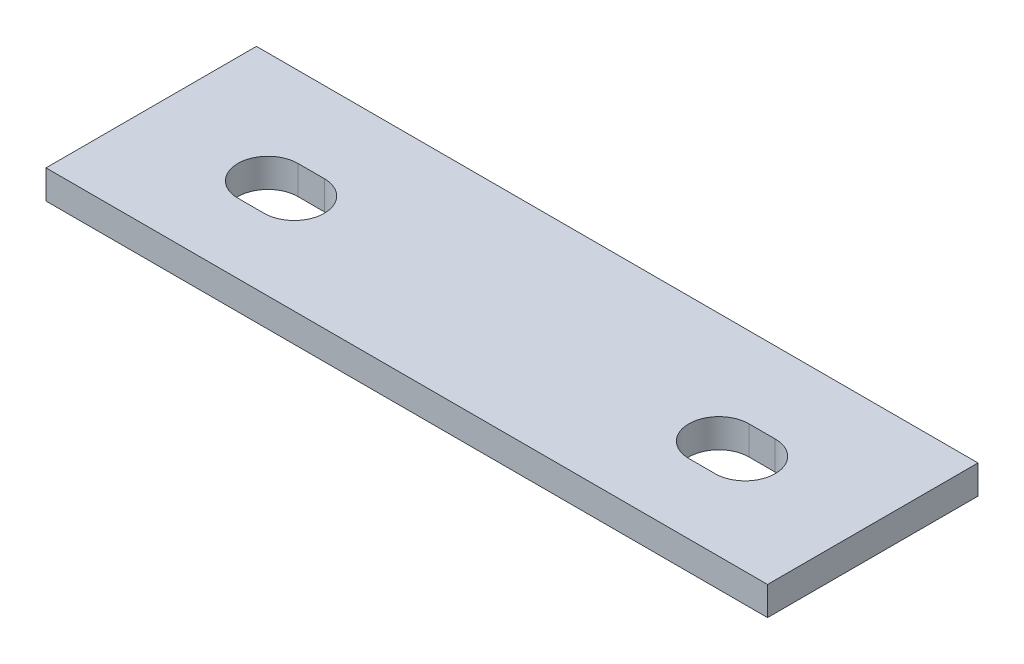
ISO-10303-21;
HEADER;
FILE_DESCRIPTION(('STEP AP214'),'2;1');
FILE_NAME('part.step','',(''),(''),'','','');
FILE_SCHEMA(('AUTOMOTIVE_DESIGN { 1 0 10303 214 1 1 1 1 }'));
ENDSEC;
DATA;
#1=APPLICATION_CONTEXT('core data for automotive mechanical design processes');
#2=APPLICATION_PROTOCOL_DEFINITION('international standard','automotive_design',2000,#1);
#3=PRODUCT_CONTEXT('',#1,'mechanical');
#4=PRODUCT('Part','Part','',(#3));
#5=PRODUCT_RELATED_PRODUCT_CATEGORY('part','',(#4));
#6=PRODUCT_DEFINITION_FORMATION('','',#4);
#7=PRODUCT_DEFINITION_CONTEXT('part definition',#1,'design');
#8=PRODUCT_DEFINITION('design','',#6,#7);
#9=PRODUCT_DEFINITION_SHAPE('','',#8);
#10=(LENGTH_UNIT() NAMED_UNIT(*) SI_UNIT(.MILLI.,.METRE.));
#11=(NAMED_UNIT(*) PLANE_ANGLE_UNIT() SI_UNIT($,.RADIAN.));
#12=(NAMED_UNIT(*) SI_UNIT($,.STERADIAN.) SOLID_ANGLE_UNIT());
#13=UNCERTAINTY_MEASURE_WITH_UNIT(LENGTH_MEASURE(1.E-05),#10,'distance_accuracy_value','');
#14=(GEOMETRIC_REPRESENTATION_CONTEXT(3) GLOBAL_UNCERTAINTY_ASSIGNED_CONTEXT((#13)) GLOBAL_UNIT_ASSIGNED_CONTEXT((#10,
#11,#12)) REPRESENTATION_CONTEXT('',''));
#15=CARTESIAN_POINT('',(0.,0.,0.));
#16=DIRECTION('',(0.,0.,1.));
#17=DIRECTION('',(1.,0.,0.));
#18=AXIS2_PLACEMENT_3D('',#15,#16,#17);
#19=CARTESIAN_POINT('',(0.,-6.07314,0.));
#20=DIRECTION('',(-1.,0.,0.));
#21=DIRECTION('',(0.,0.,1.));
#22=AXIS2_PLACEMENT_3D('',#19,#20,#21);
#23=PLANE('',#22);
#24=DIRECTION('',(0.,0.,1.));
#25=VECTOR('',#24,1.);
#26=CARTESIAN_POINT('',(0.,0.,0.));
#27=LINE('',#26,#25);
#28=CARTESIAN_POINT('',(0.,0.,-44.45));
#29=VERTEX_POINT('',#28);
#30=CARTESIAN_POINT('',(0.,0.,0.));
#31=VERTEX_POINT('',#30);
#32=EDGE_CURVE('E151',#29,#31,#27,.T.);
#33=ORIENTED_EDGE('',*,*,#32,.F.);
#34=DIRECTION('',(0.,1.,0.));
#35=VECTOR('',#34,1.);
#36=CARTESIAN_POINT('',(0.,-6.07314,-44.45));
#37=LINE('',#36,#35);
#38=CARTESIAN_POINT('',(0.,-6.07314,-44.45));
#39=VERTEX_POINT('',#38);
#40=EDGE_CURVE('E11',#39,#29,#37,.T.);
#41=ORIENTED_EDGE('',*,*,#40,.F.);
#42=DIRECTION('',(0.,0.,1.));
#43=VECTOR('',#42,1.);
#44=CARTESIAN_POINT('',(0.,-6.07314,0.));
#45=LINE('',#44,#43);
#46=CARTESIAN_POINT('',(0.,-6.07314,0.));
#47=VERTEX_POINT('',#46);
#48=EDGE_CURVE('E170',#39,#47,#45,.T.);
#49=ORIENTED_EDGE('',*,*,#48,.T.);
#50=DIRECTION('',(0.,1.,0.));
#51=VECTOR('',#50,1.);
#52=CARTESIAN_POINT('',(0.,-6.07314,0.));
#53=LINE('',#52,#51);
#54=EDGE_CURVE('E92',#47,#31,#53,.T.);
#55=ORIENTED_EDGE('',*,*,#54,.T.);
#56=EDGE_LOOP('',(#33,#41,#49,#55));
#57=FACE_BOUND('',#56,.T.);
#58=ADVANCED_FACE('F38',(#57),#23,.T.);
#59=CARTESIAN_POINT('',(0.,-6.07314,-44.45));
#60=DIRECTION('',(0.,0.,-1.));
#61=DIRECTION('',(-1.,0.,0.));
#62=AXIS2_PLACEMENT_3D('',#59,#60,#61);
#63=PLANE('',#62);
#64=DIRECTION('',(-1.,0.,0.));
#65=VECTOR('',#64,1.);
#66=CARTESIAN_POINT('',(0.,0.,-44.45));
#67=LINE('',#66,#65);
#68=CARTESIAN_POINT('',(152.4,0.,-44.45));
#69=VERTEX_POINT('',#68);
#70=EDGE_CURVE('E169',#69,#29,#67,.T.);
#71=ORIENTED_EDGE('',*,*,#70,.F.);
#72=DIRECTION('',(0.,1.,0.));
#73=VECTOR('',#72,1.);
#74=CARTESIAN_POINT('',(152.4,-6.07314,-44.45));
#75=LINE('',#74,#73);
#76=CARTESIAN_POINT('',(152.4,-6.07314,-44.45));
#77=VERTEX_POINT('',#76);
#78=EDGE_CURVE('E46',#77,#69,#75,.T.);
#79=ORIENTED_EDGE('',*,*,#78,.F.);
#80=DIRECTION('',(-1.,0.,0.));
#81=VECTOR('',#80,1.);
#82=CARTESIAN_POINT('',(0.,-6.07314,-44.45));
#83=LINE('',#82,#81);
#84=EDGE_CURVE('E164',#77,#39,#83,.T.);
#85=ORIENTED_EDGE('',*,*,#84,.T.);
#86=ORIENTED_EDGE('',*,*,#40,.T.);
#87=EDGE_LOOP('',(#71,#79,#85,#86));
#88=FACE_BOUND('',#87,.T.);
#89=ADVANCED_FACE('F216',(#88),#63,.T.);
#90=CARTESIAN_POINT('',(152.4,-6.07314,0.));
#91=DIRECTION('',(1.,0.,0.));
#92=DIRECTION('',(0.,0.,-1.));
#93=AXIS2_PLACEMENT_3D('',#90,#91,#92);
#94=PLANE('',#93);
#95=DIRECTION('',(0.,0.,-1.));
#96=VECTOR('',#95,1.);
#97=CARTESIAN_POINT('',(152.4,0.,0.));
#98=LINE('',#97,#96);
#99=CARTESIAN_POINT('',(152.4,0.,0.));
#100=VERTEX_POINT('',#99);
#101=EDGE_CURVE('E161',#100,#69,#98,.T.);
#102=ORIENTED_EDGE('',*,*,#101,.F.);
#103=DIRECTION('',(0.,1.,0.));
#104=VECTOR('',#103,1.);
#105=CARTESIAN_POINT('',(152.4,-6.07314,0.));
#106=LINE('',#105,#104);
#107=CARTESIAN_POINT('',(152.4,-6.07314,0.));
#108=VERTEX_POINT('',#107);
#109=EDGE_CURVE('E173',#108,#100,#106,.T.);
#110=ORIENTED_EDGE('',*,*,#109,.F.);
#111=DIRECTION('',(0.,0.,-1.));
#112=VECTOR('',#111,1.);
#113=CARTESIAN_POINT('',(152.4,-6.07314,0.));
#114=LINE('',#113,#112);
#115=EDGE_CURVE('E205',#108,#77,#114,.T.);
#116=ORIENTED_EDGE('',*,*,#115,.T.);
#117=ORIENTED_EDGE('',*,*,#78,.T.);
#118=EDGE_LOOP('',(#102,#110,#116,#117));
#119=FACE_BOUND('',#118,.T.);
#120=ADVANCED_FACE('F267',(#119),#94,.T.);
#121=CARTESIAN_POINT('',(0.,-6.07314,0.));
#122=DIRECTION('',(0.,0.,1.));
#123=DIRECTION('',(1.,0.,0.));
#124=AXIS2_PLACEMENT_3D('',#121,#122,#123);
#125=PLANE('',#124);
#126=DIRECTION('',(1.,0.,0.));
#127=VECTOR('',#126,1.);
#128=CARTESIAN_POINT('',(0.,0.,0.));
#129=LINE('',#128,#127);
#130=EDGE_CURVE('E156',#31,#100,#129,.T.);
#131=ORIENTED_EDGE('',*,*,#130,.F.);
#132=ORIENTED_EDGE('',*,*,#54,.F.);
#133=DIRECTION('',(1.,0.,0.));
#134=VECTOR('',#133,1.);
#135=CARTESIAN_POINT('',(0.,-6.07314,0.));
#136=LINE('',#135,#134);
#137=EDGE_CURVE('E203',#47,#108,#136,.T.);
#138=ORIENTED_EDGE('',*,*,#137,.T.);
#139=ORIENTED_EDGE('',*,*,#109,.T.);
#140=EDGE_LOOP('',(#131,#132,#138,#139));
#141=FACE_BOUND('',#140,.T.);
#142=ADVANCED_FACE('F271',(#141),#125,.T.);
#143=CARTESIAN_POINT('',(0.,-6.07314,0.));
#144=DIRECTION('',(0.,-1.,0.));
#145=DIRECTION('',(0.,0.,-1.));
#146=AXIS2_PLACEMENT_3D('',#143,#144,#145);
#147=PLANE('',#146);
#148=DIRECTION('',(-1.,0.,0.));
#149=VECTOR('',#148,1.);
#150=CARTESIAN_POINT('',(2.22044604925031E-13,-6.07314,-27.4218400000007));
#151=LINE('',#150,#149);
#152=CARTESIAN_POINT('',(121.046875,-6.07314,-27.4218399999996));
#153=VERTEX_POINT('',#152);
#154=CARTESIAN_POINT('',(126.603125,-6.07314,-27.4218399999996));
#155=VERTEX_POINT('',#154);
#156=EDGE_CURVE('E41',#153,#155,#151,.F.);
#157=ORIENTED_EDGE('',*,*,#156,.F.);
#158=CARTESIAN_POINT('',(121.046875,-6.07314,-21.0718399999995));
#159=DIRECTION('',(0.,-1.,0.));
#160=DIRECTION('',(0.,0.,-1.));
#161=AXIS2_PLACEMENT_3D('',#158,#159,#160);
#162=CIRCLE('',#161,6.35000000000007);
#163=CARTESIAN_POINT('',(121.046875,-6.07314,-14.7218399999994));
#164=VERTEX_POINT('',#163);
#165=EDGE_CURVE('E83',#164,#153,#162,.T.);
#166=ORIENTED_EDGE('',*,*,#165,.F.);
#167=DIRECTION('',(1.,0.,0.));
#168=VECTOR('',#167,1.);
#169=CARTESIAN_POINT('',(0.,-6.07314,-14.7218399999994));
#170=LINE('',#169,#168);
#171=CARTESIAN_POINT('',(126.603125,-6.07314,-14.7218399999994));
#172=VERTEX_POINT('',#171);
#173=EDGE_CURVE('E147',#172,#164,#170,.F.);
#174=ORIENTED_EDGE('',*,*,#173,.F.);
#175=CARTESIAN_POINT('',(126.603125,-6.07314,-21.0718399999995));
#176=DIRECTION('',(0.,-1.,0.));
#177=DIRECTION('',(0.,0.,-1.));
#178=AXIS2_PLACEMENT_3D('',#175,#176,#177);
#179=CIRCLE('',#178,6.35000000000005);
#180=EDGE_CURVE('E145',#155,#172,#179,.T.);
#181=ORIENTED_EDGE('',*,*,#180,.F.);
#182=EDGE_LOOP('',(#157,#166,#174,#181));
#183=FACE_BOUND('',#182,.T.);
#184=DIRECTION('',(1.,0.,0.));
#185=VECTOR('',#184,1.);
#186=CARTESIAN_POINT('',(0.,-6.07314,-14.7218399999994));
#187=LINE('',#186,#185);
#188=CARTESIAN_POINT('',(31.3531250000004,-6.07314,-14.7218399999994));
#189=VERTEX_POINT('',#188);
#190=CARTESIAN_POINT('',(25.7968750000004,-6.07314,-14.7218399999994));
#191=VERTEX_POINT('',#190);
#192=EDGE_CURVE('E132',#189,#191,#187,.F.);
#193=ORIENTED_EDGE('',*,*,#192,.F.);
#194=CARTESIAN_POINT('',(31.3531250000004,-6.07314,-21.0718399999995));
#195=DIRECTION('',(0.,-1.,0.));
#196=DIRECTION('',(0.,0.,-1.));
#197=AXIS2_PLACEMENT_3D('',#194,#195,#196);
#198=CIRCLE('',#197,6.35000000000005);
#199=CARTESIAN_POINT('',(31.3531250000005,-6.07314,-27.4218399999996));
#200=VERTEX_POINT('',#199);
#201=EDGE_CURVE('E122',#200,#189,#198,.T.);
#202=ORIENTED_EDGE('',*,*,#201,.F.);
#203=DIRECTION('',(-1.,0.,0.));
#204=VECTOR('',#203,1.);
#205=CARTESIAN_POINT('',(2.77555756156289E-13,-6.07314,-27.4218399999998));
#206=LINE('',#205,#204);
#207=CARTESIAN_POINT('',(25.7968750000005,-6.07314,-27.4218399999996));
#208=VERTEX_POINT('',#207);
#209=EDGE_CURVE('E116',#208,#200,#206,.F.);
#210=ORIENTED_EDGE('',*,*,#209,.F.);
#211=CARTESIAN_POINT('',(25.7968750000004,-6.07314,-21.0718399999995));
#212=DIRECTION('',(0.,-1.,0.));
#213=DIRECTION('',(0.,0.,-1.));
#214=AXIS2_PLACEMENT_3D('',#211,#212,#213);
#215=CIRCLE('',#214,6.35000000000008);
#216=EDGE_CURVE('E144',#191,#208,#215,.T.);
#217=ORIENTED_EDGE('',*,*,#216,.F.);
#218=EDGE_LOOP('',(#193,#202,#210,#217));
#219=FACE_BOUND('',#218,.T.);
#220=ORIENTED_EDGE('',*,*,#48,.F.);
#221=ORIENTED_EDGE('',*,*,#84,.F.);
#222=ORIENTED_EDGE('',*,*,#115,.F.);
#223=ORIENTED_EDGE('',*,*,#137,.F.);
#224=EDGE_LOOP('',(#220,#221,#222,#223));
#225=FACE_BOUND('',#224,.T.);
#226=ADVANCED_FACE('F142',(#183,#219,#225),#147,.T.);
#227=CARTESIAN_POINT('',(0.,0.,0.));
#228=DIRECTION('',(0.,-1.,0.));
#229=DIRECTION('',(0.,0.,-1.));
#230=AXIS2_PLACEMENT_3D('',#227,#228,#229);
#231=PLANE('',#230);
#232=CARTESIAN_POINT('',(121.046875,0.,-21.0718399999995));
#233=DIRECTION('',(0.,-1.,0.));
#234=DIRECTION('',(0.,0.,-1.));
#235=AXIS2_PLACEMENT_3D('',#232,#233,#234);
#236=CIRCLE('',#235,6.35000000000007);
#237=CARTESIAN_POINT('',(121.046875,0.,-14.7218399999994));
#238=VERTEX_POINT('',#237);
#239=CARTESIAN_POINT('',(121.046875,0.,-27.4218399999996));
#240=VERTEX_POINT('',#239);
#241=EDGE_CURVE('E186',#238,#240,#236,.T.);
#242=ORIENTED_EDGE('',*,*,#241,.T.);
#243=DIRECTION('',(1.,0.,0.));
#244=VECTOR('',#243,1.);
#245=CARTESIAN_POINT('',(2.22044604925031E-13,0.,-27.4218400000007));
#246=LINE('',#245,#244);
#247=CARTESIAN_POINT('',(126.603125,0.,-27.4218399999996));
#248=VERTEX_POINT('',#247);
#249=EDGE_CURVE('E140',#240,#248,#246,.T.);
#250=ORIENTED_EDGE('',*,*,#249,.T.);
#251=CARTESIAN_POINT('',(126.603125,0.,-21.0718399999995));
#252=DIRECTION('',(0.,-1.,0.));
#253=DIRECTION('',(0.,0.,-1.));
#254=AXIS2_PLACEMENT_3D('',#251,#252,#253);
#255=CIRCLE('',#254,6.35000000000005);
#256=CARTESIAN_POINT('',(126.603125,0.,-14.7218399999995));
#257=VERTEX_POINT('',#256);
#258=EDGE_CURVE('E239',#248,#257,#255,.T.);
#259=ORIENTED_EDGE('',*,*,#258,.T.);
#260=DIRECTION('',(-1.,0.,0.));
#261=VECTOR('',#260,1.);
#262=CARTESIAN_POINT('',(0.,0.,-14.7218399999994));
#263=LINE('',#262,#261);
#264=EDGE_CURVE('E243',#257,#238,#263,.T.);
#265=ORIENTED_EDGE('',*,*,#264,.T.);
#266=EDGE_LOOP('',(#242,#250,#259,#265));
#267=FACE_BOUND('',#266,.T.);
#268=CARTESIAN_POINT('',(31.3531250000004,0.,-21.0718399999995));
#269=DIRECTION('',(0.,-1.,0.));
#270=DIRECTION('',(0.,0.,-1.));
#271=AXIS2_PLACEMENT_3D('',#268,#269,#270);
#272=CIRCLE('',#271,6.35000000000005);
#273=CARTESIAN_POINT('',(31.3531250000004,0.,-27.4218399999996));
#274=VERTEX_POINT('',#273);
#275=CARTESIAN_POINT('',(31.3531250000004,0.,-14.7218399999994));
#276=VERTEX_POINT('',#275);
#277=EDGE_CURVE('E196',#274,#276,#272,.T.);
#278=ORIENTED_EDGE('',*,*,#277,.T.);
#279=DIRECTION('',(-1.,0.,0.));
#280=VECTOR('',#279,1.);
#281=CARTESIAN_POINT('',(0.,0.,-14.7218399999994));
#282=LINE('',#281,#280);
#283=CARTESIAN_POINT('',(25.7968750000004,0.,-14.7218399999994));
#284=VERTEX_POINT('',#283);
#285=EDGE_CURVE('E138',#276,#284,#282,.T.);
#286=ORIENTED_EDGE('',*,*,#285,.T.);
#287=CARTESIAN_POINT('',(25.7968750000004,0.,-21.0718399999995));
#288=DIRECTION('',(0.,-1.,0.));
#289=DIRECTION('',(0.,0.,-1.));
#290=AXIS2_PLACEMENT_3D('',#287,#288,#289);
#291=CIRCLE('',#290,6.35000000000008);
#292=CARTESIAN_POINT('',(25.7968750000004,0.,-27.4218399999996));
#293=VERTEX_POINT('',#292);
#294=EDGE_CURVE('E190',#284,#293,#291,.T.);
#295=ORIENTED_EDGE('',*,*,#294,.T.);
#296=DIRECTION('',(1.,0.,0.));
#297=VECTOR('',#296,1.);
#298=CARTESIAN_POINT('',(2.77555756156289E-13,0.,-27.4218399999998));
#299=LINE('',#298,#297);
#300=EDGE_CURVE('E193',#293,#274,#299,.T.);
#301=ORIENTED_EDGE('',*,*,#300,.T.);
#302=EDGE_LOOP('',(#278,#286,#295,#301));
#303=FACE_BOUND('',#302,.T.);
#304=ORIENTED_EDGE('',*,*,#32,.T.);
#305=ORIENTED_EDGE('',*,*,#130,.T.);
#306=ORIENTED_EDGE('',*,*,#101,.T.);
#307=ORIENTED_EDGE('',*,*,#70,.T.);
#308=EDGE_LOOP('',(#304,#305,#306,#307));
#309=FACE_BOUND('',#308,.T.);
#310=ADVANCED_FACE('F245',(#267,#303,#309),#231,.F.);
#311=CARTESIAN_POINT('',(0.,0.,-14.7218399999994));
#312=DIRECTION('',(0.,0.,1.));
#313=DIRECTION('',(1.,0.,0.));
#314=AXIS2_PLACEMENT_3D('',#311,#312,#313);
#315=PLANE('',#314);
#316=ORIENTED_EDGE('',*,*,#192,.T.);
#317=DIRECTION('',(0.,-1.,0.));
#318=VECTOR('',#317,1.);
#319=CARTESIAN_POINT('',(25.7968750000004,0.,-14.7218399999994));
#320=LINE('',#319,#318);
#321=EDGE_CURVE('E63',#284,#191,#320,.T.);
#322=ORIENTED_EDGE('',*,*,#321,.F.);
#323=ORIENTED_EDGE('',*,*,#285,.F.);
#324=DIRECTION('',(0.,-1.,0.));
#325=VECTOR('',#324,1.);
#326=CARTESIAN_POINT('',(31.3531250000004,0.,-14.7218399999994));
#327=LINE('',#326,#325);
#328=EDGE_CURVE('E127',#276,#189,#327,.T.);
#329=ORIENTED_EDGE('',*,*,#328,.T.);
#330=EDGE_LOOP('',(#316,#322,#323,#329));
#331=FACE_BOUND('',#330,.T.);
#332=ADVANCED_FACE('F135',(#331),#315,.F.);
#333=CARTESIAN_POINT('',(31.3531250000004,0.,-21.0718399999995));
#334=DIRECTION('',(0.,-1.,0.));
#335=DIRECTION('',(0.,0.,-1.));
#336=AXIS2_PLACEMENT_3D('',#333,#334,#335);
#337=CYLINDRICAL_SURFACE('',#336,6.35000000000005);
#338=ORIENTED_EDGE('',*,*,#201,.T.);
#339=ORIENTED_EDGE('',*,*,#328,.F.);
#340=ORIENTED_EDGE('',*,*,#277,.F.);
#341=DIRECTION('',(0.,-1.,0.));
#342=VECTOR('',#341,1.);
#343=CARTESIAN_POINT('',(31.3531250000004,0.,-27.4218399999996));
#344=LINE('',#343,#342);
#345=EDGE_CURVE('E129',#274,#200,#344,.T.);
#346=ORIENTED_EDGE('',*,*,#345,.T.);
#347=EDGE_LOOP('',(#338,#339,#340,#346));
#348=FACE_BOUND('',#347,.T.);
#349=ADVANCED_FACE('F124',(#348),#337,.F.);
#350=CARTESIAN_POINT('',(2.77555756156289E-13,0.,-27.4218399999998));
#351=DIRECTION('',(0.,0.,-1.));
#352=DIRECTION('',(-1.,0.,0.));
#353=AXIS2_PLACEMENT_3D('',#350,#351,#352);
#354=PLANE('',#353);
#355=ORIENTED_EDGE('',*,*,#209,.T.);
#356=ORIENTED_EDGE('',*,*,#345,.F.);
#357=ORIENTED_EDGE('',*,*,#300,.F.);
#358=DIRECTION('',(0.,-1.,0.));
#359=VECTOR('',#358,1.);
#360=CARTESIAN_POINT('',(25.7968750000004,0.,-27.4218399999996));
#361=LINE('',#360,#359);
#362=EDGE_CURVE('E198',#293,#208,#361,.T.);
#363=ORIENTED_EDGE('',*,*,#362,.T.);
#364=EDGE_LOOP('',(#355,#356,#357,#363));
#365=FACE_BOUND('',#364,.T.);
#366=ADVANCED_FACE('F287',(#365),#354,.F.);
#367=CARTESIAN_POINT('',(25.7968750000004,0.,-21.0718399999995));
#368=DIRECTION('',(0.,-1.,0.));
#369=DIRECTION('',(0.,0.,-1.));
#370=AXIS2_PLACEMENT_3D('',#367,#368,#369);
#371=CYLINDRICAL_SURFACE('',#370,6.35000000000008);
#372=ORIENTED_EDGE('',*,*,#216,.T.);
#373=ORIENTED_EDGE('',*,*,#362,.F.);
#374=ORIENTED_EDGE('',*,*,#294,.F.);
#375=ORIENTED_EDGE('',*,*,#321,.T.);
#376=EDGE_LOOP('',(#372,#373,#374,#375));
#377=FACE_BOUND('',#376,.T.);
#378=ADVANCED_FACE('F261',(#377),#371,.F.);
#379=CARTESIAN_POINT('',(2.22044604925031E-13,0.,-27.4218400000007));
#380=DIRECTION('',(0.,0.,-1.));
#381=DIRECTION('',(-1.,0.,0.));
#382=AXIS2_PLACEMENT_3D('',#379,#380,#381);
#383=PLANE('',#382);
#384=ORIENTED_EDGE('',*,*,#156,.T.);
#385=DIRECTION('',(0.,-1.,0.));
#386=VECTOR('',#385,1.);
#387=CARTESIAN_POINT('',(126.603125,0.,-27.4218399999996));
#388=LINE('',#387,#386);
#389=EDGE_CURVE('E54',#248,#155,#388,.T.);
#390=ORIENTED_EDGE('',*,*,#389,.F.);
#391=ORIENTED_EDGE('',*,*,#249,.F.);
#392=DIRECTION('',(0.,-1.,0.));
#393=VECTOR('',#392,1.);
#394=CARTESIAN_POINT('',(121.046875,0.,-27.4218399999996));
#395=LINE('',#394,#393);
#396=EDGE_CURVE('E176',#240,#153,#395,.T.);
#397=ORIENTED_EDGE('',*,*,#396,.T.);
#398=EDGE_LOOP('',(#384,#390,#391,#397));
#399=FACE_BOUND('',#398,.T.);
#400=ADVANCED_FACE('F234',(#399),#383,.F.);
#401=CARTESIAN_POINT('',(121.046875,0.,-21.0718399999995));
#402=DIRECTION('',(0.,-1.,0.));
#403=DIRECTION('',(0.,0.,-1.));
#404=AXIS2_PLACEMENT_3D('',#401,#402,#403);
#405=CYLINDRICAL_SURFACE('',#404,6.35000000000007);
#406=ORIENTED_EDGE('',*,*,#165,.T.);
#407=ORIENTED_EDGE('',*,*,#396,.F.);
#408=ORIENTED_EDGE('',*,*,#241,.F.);
#409=DIRECTION('',(0.,-1.,0.));
#410=VECTOR('',#409,1.);
#411=CARTESIAN_POINT('',(121.046875,0.,-14.7218399999994));
#412=LINE('',#411,#410);
#413=EDGE_CURVE('E178',#238,#164,#412,.T.);
#414=ORIENTED_EDGE('',*,*,#413,.T.);
#415=EDGE_LOOP('',(#406,#407,#408,#414));
#416=FACE_BOUND('',#415,.T.);
#417=ADVANCED_FACE('F253',(#416),#405,.F.);
#418=CARTESIAN_POINT('',(0.,0.,-14.7218399999994));
#419=DIRECTION('',(0.,0.,1.));
#420=DIRECTION('',(1.,0.,0.));
#421=AXIS2_PLACEMENT_3D('',#418,#419,#420);
#422=PLANE('',#421);
#423=ORIENTED_EDGE('',*,*,#173,.T.);
#424=ORIENTED_EDGE('',*,*,#413,.F.);
#425=ORIENTED_EDGE('',*,*,#264,.F.);
#426=DIRECTION('',(0.,-1.,0.));
#427=VECTOR('',#426,1.);
#428=CARTESIAN_POINT('',(126.603125,0.,-14.7218399999994));
#429=LINE('',#428,#427);
#430=EDGE_CURVE('E181',#257,#172,#429,.T.);
#431=ORIENTED_EDGE('',*,*,#430,.T.);
#432=EDGE_LOOP('',(#423,#424,#425,#431));
#433=FACE_BOUND('',#432,.T.);
#434=ADVANCED_FACE('F251',(#433),#422,.F.);
#435=CARTESIAN_POINT('',(126.603125,0.,-21.0718399999995));
#436=DIRECTION('',(0.,-1.,0.));
#437=DIRECTION('',(0.,0.,-1.));
#438=AXIS2_PLACEMENT_3D('',#435,#436,#437);
#439=CYLINDRICAL_SURFACE('',#438,6.35000000000005);
#440=ORIENTED_EDGE('',*,*,#180,.T.);
#441=ORIENTED_EDGE('',*,*,#430,.F.);
#442=ORIENTED_EDGE('',*,*,#258,.F.);
#443=ORIENTED_EDGE('',*,*,#389,.T.);
#444=EDGE_LOOP('',(#440,#441,#442,#443));
#445=FACE_BOUND('',#444,.T.);
#446=ADVANCED_FACE('F240',(#445),#439,.F.);
#447=CLOSED_SHELL('',(#58,#89,#120,#142,#226,#310,#332,#349,#366,#378,#400,#417,#434,#446));
#448=MANIFOLD_SOLID_BREP('B2',#447);
#449=ADVANCED_BREP_SHAPE_REPRESENTATION('',(#18,#448),#14);
#450=SHAPE_DEFINITION_REPRESENTATION(#9,#449);
ENDSEC;
END-ISO-10303-21;
